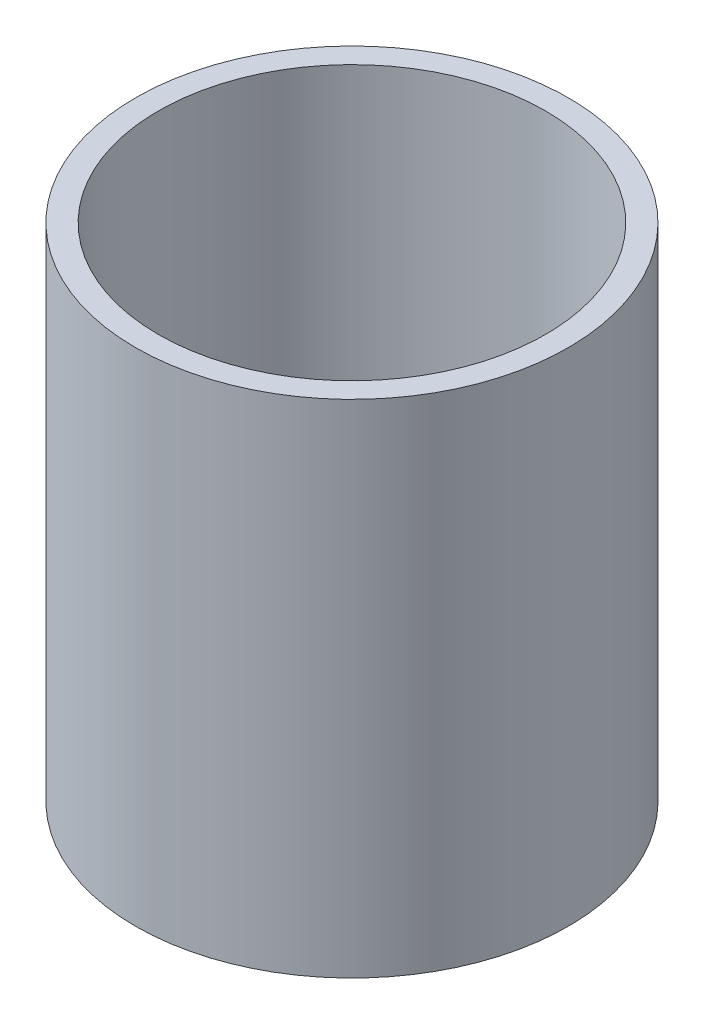
ISO-10303-21;
HEADER;
FILE_DESCRIPTION(('STEP AP214'),'2;1');
FILE_NAME('part.step','',(''),(''),'','','');
FILE_SCHEMA(('AUTOMOTIVE_DESIGN { 1 0 10303 214 1 1 1 1 }'));
ENDSEC;
DATA;
#1=APPLICATION_CONTEXT('core data for automotive mechanical design processes');
#2=APPLICATION_PROTOCOL_DEFINITION('international standard','automotive_design',2000,#1);
#3=PRODUCT_CONTEXT('',#1,'mechanical');
#4=PRODUCT('Part','Part','',(#3));
#5=PRODUCT_RELATED_PRODUCT_CATEGORY('part','',(#4));
#6=PRODUCT_DEFINITION_FORMATION('','',#4);
#7=PRODUCT_DEFINITION_CONTEXT('part definition',#1,'design');
#8=PRODUCT_DEFINITION('design','',#6,#7);
#9=PRODUCT_DEFINITION_SHAPE('','',#8);
#10=(LENGTH_UNIT() NAMED_UNIT(*) SI_UNIT(.MILLI.,.METRE.));
#11=(NAMED_UNIT(*) PLANE_ANGLE_UNIT() SI_UNIT($,.RADIAN.));
#12=(NAMED_UNIT(*) SI_UNIT($,.STERADIAN.) SOLID_ANGLE_UNIT());
#13=UNCERTAINTY_MEASURE_WITH_UNIT(LENGTH_MEASURE(1.E-05),#10,'distance_accuracy_value','');
#14=(GEOMETRIC_REPRESENTATION_CONTEXT(3) GLOBAL_UNCERTAINTY_ASSIGNED_CONTEXT((#13)) GLOBAL_UNIT_ASSIGNED_CONTEXT((#10,
#11,#12)) REPRESENTATION_CONTEXT('',''));
#15=CARTESIAN_POINT('',(0.,0.,0.));
#16=DIRECTION('',(0.,0.,1.));
#17=DIRECTION('',(1.,0.,0.));
#18=AXIS2_PLACEMENT_3D('',#15,#16,#17);
#19=CARTESIAN_POINT('',(0.,44.,0.));
#20=DIRECTION('',(0.,1.,0.));
#21=DIRECTION('',(0.,0.,1.));
#22=AXIS2_PLACEMENT_3D('',#19,#20,#21);
#23=PLANE('',#22);
#24=CARTESIAN_POINT('',(0.,44.,0.));
#25=DIRECTION('',(0.,1.,0.));
#26=DIRECTION('',(0.,0.,1.));
#27=AXIS2_PLACEMENT_3D('',#24,#25,#26);
#28=CIRCLE('',#27,19.);
#29=CARTESIAN_POINT('',(0.,44.,19.));
#30=VERTEX_POINT('',#29);
#31=EDGE_CURVE('E10',#30,#30,#28,.T.);
#32=ORIENTED_EDGE('',*,*,#31,.T.);
#33=EDGE_LOOP('',(#32));
#34=FACE_BOUND('',#33,.T.);
#35=CARTESIAN_POINT('',(0.,44.,0.));
#36=DIRECTION('',(0.,1.,0.));
#37=DIRECTION('',(0.,0.,1.));
#38=AXIS2_PLACEMENT_3D('',#35,#36,#37);
#39=CIRCLE('',#38,17.);
#40=CARTESIAN_POINT('',(0.,44.,17.));
#41=VERTEX_POINT('',#40);
#42=EDGE_CURVE('E50',#41,#41,#39,.T.);
#43=ORIENTED_EDGE('',*,*,#42,.F.);
#44=EDGE_LOOP('',(#43));
#45=FACE_BOUND('',#44,.T.);
#46=ADVANCED_FACE('F37',(#34,#45),#23,.T.);
#47=CARTESIAN_POINT('',(0.,0.,0.));
#48=DIRECTION('',(0.,1.,0.));
#49=DIRECTION('',(0.,0.,1.));
#50=AXIS2_PLACEMENT_3D('',#47,#48,#49);
#51=PLANE('',#50);
#52=CARTESIAN_POINT('',(0.,0.,0.));
#53=DIRECTION('',(0.,1.,0.));
#54=DIRECTION('',(0.,0.,1.));
#55=AXIS2_PLACEMENT_3D('',#52,#53,#54);
#56=CIRCLE('',#55,19.);
#57=CARTESIAN_POINT('',(0.,0.,19.));
#58=VERTEX_POINT('',#57);
#59=EDGE_CURVE('E41',#58,#58,#56,.T.);
#60=ORIENTED_EDGE('',*,*,#59,.F.);
#61=EDGE_LOOP('',(#60));
#62=FACE_BOUND('',#61,.T.);
#63=CARTESIAN_POINT('',(0.,0.,0.));
#64=DIRECTION('',(0.,1.,0.));
#65=DIRECTION('',(0.,0.,1.));
#66=AXIS2_PLACEMENT_3D('',#63,#64,#65);
#67=CIRCLE('',#66,17.);
#68=CARTESIAN_POINT('',(0.,0.,17.));
#69=VERTEX_POINT('',#68);
#70=EDGE_CURVE('E52',#69,#69,#67,.T.);
#71=ORIENTED_EDGE('',*,*,#70,.T.);
#72=EDGE_LOOP('',(#71));
#73=FACE_BOUND('',#72,.T.);
#74=ADVANCED_FACE('F64',(#62,#73),#51,.F.);
#75=CARTESIAN_POINT('',(0.,44.,0.));
#76=DIRECTION('',(0.,-1.,0.));
#77=DIRECTION('',(0.,0.,-1.));
#78=AXIS2_PLACEMENT_3D('',#75,#76,#77);
#79=CYLINDRICAL_SURFACE('',#78,19.);
#80=ORIENTED_EDGE('',*,*,#31,.F.);
#81=EDGE_LOOP('',(#80));
#82=FACE_BOUND('',#81,.T.);
#83=ORIENTED_EDGE('',*,*,#59,.T.);
#84=EDGE_LOOP('',(#83));
#85=FACE_BOUND('',#84,.T.);
#86=ADVANCED_FACE('F39',(#82,#85),#79,.T.);
#87=CARTESIAN_POINT('',(0.,44.,0.));
#88=DIRECTION('',(0.,-1.,0.));
#89=DIRECTION('',(0.,0.,-1.));
#90=AXIS2_PLACEMENT_3D('',#87,#88,#89);
#91=CYLINDRICAL_SURFACE('',#90,17.);
#92=ORIENTED_EDGE('',*,*,#42,.T.);
#93=EDGE_LOOP('',(#92));
#94=FACE_BOUND('',#93,.T.);
#95=ORIENTED_EDGE('',*,*,#70,.F.);
#96=EDGE_LOOP('',(#95));
#97=FACE_BOUND('',#96,.T.);
#98=ADVANCED_FACE('F60',(#94,#97),#91,.F.);
#99=CLOSED_SHELL('',(#46,#74,#86,#98));
#100=MANIFOLD_SOLID_BREP('B2',#99);
#101=ADVANCED_BREP_SHAPE_REPRESENTATION('',(#18,#100),#14);
#102=SHAPE_DEFINITION_REPRESENTATION(#9,#101);
ENDSEC;
END-ISO-10303-21;
